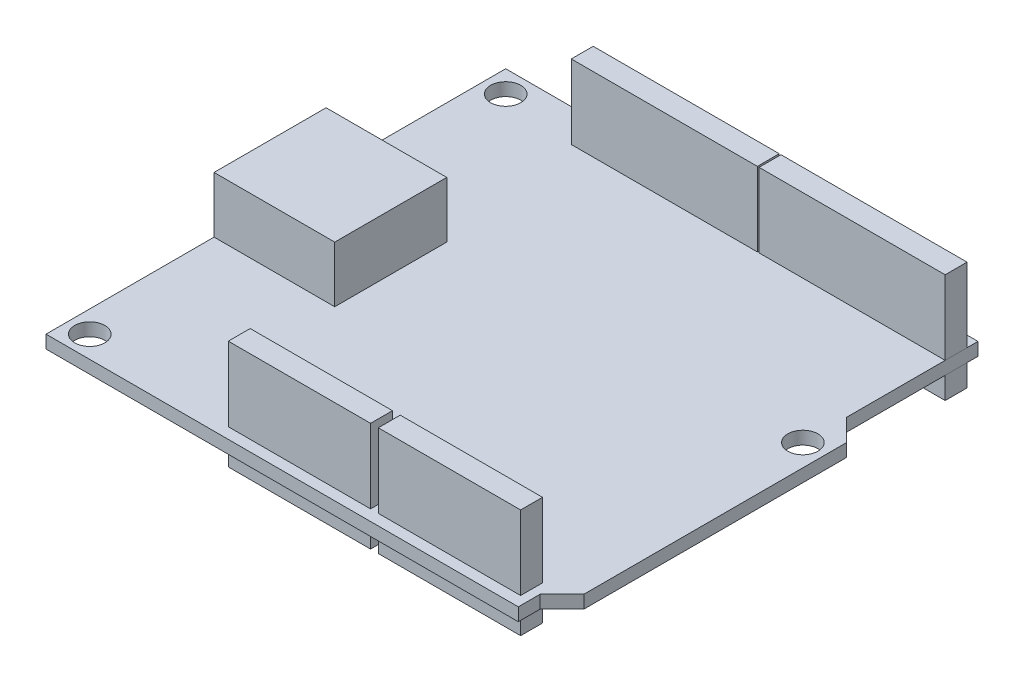
ISO-10303-21;
HEADER;
FILE_DESCRIPTION(('STEP AP214'),'2;1');
FILE_NAME('part.step','',(''),(''),'','','');
FILE_SCHEMA(('AUTOMOTIVE_DESIGN { 1 0 10303 214 1 1 1 1 }'));
ENDSEC;
DATA;
#1=APPLICATION_CONTEXT('core data for automotive mechanical design processes');
#2=APPLICATION_PROTOCOL_DEFINITION('international standard','automotive_design',2000,#1);
#3=PRODUCT_CONTEXT('',#1,'mechanical');
#4=PRODUCT('Part','Part','',(#3));
#5=PRODUCT_RELATED_PRODUCT_CATEGORY('part','',(#4));
#6=PRODUCT_DEFINITION_FORMATION('','',#4);
#7=PRODUCT_DEFINITION_CONTEXT('part definition',#1,'design');
#8=PRODUCT_DEFINITION('design','',#6,#7);
#9=PRODUCT_DEFINITION_SHAPE('','',#8);
#10=(LENGTH_UNIT() NAMED_UNIT(*) SI_UNIT(.MILLI.,.METRE.));
#11=(NAMED_UNIT(*) PLANE_ANGLE_UNIT() SI_UNIT($,.RADIAN.));
#12=(NAMED_UNIT(*) SI_UNIT($,.STERADIAN.) SOLID_ANGLE_UNIT());
#13=UNCERTAINTY_MEASURE_WITH_UNIT(LENGTH_MEASURE(1.E-05),#10,'distance_accuracy_value','');
#14=(GEOMETRIC_REPRESENTATION_CONTEXT(3) GLOBAL_UNCERTAINTY_ASSIGNED_CONTEXT((#13)) GLOBAL_UNIT_ASSIGNED_CONTEXT((#10,
#11,#12)) REPRESENTATION_CONTEXT('',''));
#15=CARTESIAN_POINT('',(0.,0.,0.));
#16=DIRECTION('',(0.,0.,1.));
#17=DIRECTION('',(1.,0.,0.));
#18=AXIS2_PLACEMENT_3D('',#15,#16,#17);
#19=CARTESIAN_POINT('',(5.809,-2.54,-25.4));
#20=DIRECTION('',(-1.,0.,0.));
#21=DIRECTION('',(0.,0.,1.));
#22=AXIS2_PLACEMENT_3D('',#19,#20,#21);
#23=PLANE('',#22);
#24=DIRECTION('',(0.,1.,0.));
#25=VECTOR('',#24,1.);
#26=CARTESIAN_POINT('',(5.809,-2.54,-22.86));
#27=LINE('',#26,#25);
#28=CARTESIAN_POINT('',(5.809,-2.54,-22.86));
#29=VERTEX_POINT('',#28);
#30=CARTESIAN_POINT('',(5.809,10.1,-22.86));
#31=VERTEX_POINT('',#30);
#32=EDGE_CURVE('E50',#29,#31,#27,.T.);
#33=ORIENTED_EDGE('',*,*,#32,.T.);
#34=DIRECTION('',(0.,0.,1.));
#35=VECTOR('',#34,1.);
#36=CARTESIAN_POINT('',(5.809,10.1,-25.4));
#37=LINE('',#36,#35);
#38=CARTESIAN_POINT('',(5.809,10.1,-25.4));
#39=VERTEX_POINT('',#38);
#40=EDGE_CURVE('E87',#39,#31,#37,.T.);
#41=ORIENTED_EDGE('',*,*,#40,.F.);
#42=DIRECTION('',(0.,1.,0.));
#43=VECTOR('',#42,1.);
#44=CARTESIAN_POINT('',(5.809,-2.54,-25.4));
#45=LINE('',#44,#43);
#46=CARTESIAN_POINT('',(5.809,-2.54,-25.4));
#47=VERTEX_POINT('',#46);
#48=EDGE_CURVE('E12',#47,#39,#45,.T.);
#49=ORIENTED_EDGE('',*,*,#48,.F.);
#50=DIRECTION('',(0.,0.,1.));
#51=VECTOR('',#50,1.);
#52=CARTESIAN_POINT('',(5.809,-2.54,-25.4));
#53=LINE('',#52,#51);
#54=EDGE_CURVE('E88',#47,#29,#53,.T.);
#55=ORIENTED_EDGE('',*,*,#54,.T.);
#56=EDGE_LOOP('',(#33,#41,#49,#55));
#57=FACE_BOUND('',#56,.T.);
#58=ADVANCED_FACE('F47',(#57),#23,.T.);
#59=CARTESIAN_POINT('',(5.809,-2.54,-25.4));
#60=DIRECTION('',(0.,0.,-1.));
#61=DIRECTION('',(-1.,0.,0.));
#62=AXIS2_PLACEMENT_3D('',#59,#60,#61);
#63=PLANE('',#62);
#64=ORIENTED_EDGE('',*,*,#48,.T.);
#65=DIRECTION('',(-1.,0.,0.));
#66=VECTOR('',#65,1.);
#67=CARTESIAN_POINT('',(5.809,10.1,-25.4));
#68=LINE('',#67,#66);
#69=CARTESIAN_POINT('',(27.399,10.1,-25.4));
#70=VERTEX_POINT('',#69);
#71=EDGE_CURVE('E104',#70,#39,#68,.T.);
#72=ORIENTED_EDGE('',*,*,#71,.F.);
#73=DIRECTION('',(0.,1.,0.));
#74=VECTOR('',#73,1.);
#75=CARTESIAN_POINT('',(27.399,-2.54,-25.4));
#76=LINE('',#75,#74);
#77=CARTESIAN_POINT('',(27.399,-2.54,-25.4));
#78=VERTEX_POINT('',#77);
#79=EDGE_CURVE('E55',#78,#70,#76,.T.);
#80=ORIENTED_EDGE('',*,*,#79,.F.);
#81=DIRECTION('',(-1.,0.,0.));
#82=VECTOR('',#81,1.);
#83=CARTESIAN_POINT('',(5.809,-2.54,-25.4));
#84=LINE('',#83,#82);
#85=EDGE_CURVE('E93',#78,#47,#84,.T.);
#86=ORIENTED_EDGE('',*,*,#85,.T.);
#87=EDGE_LOOP('',(#64,#72,#80,#86));
#88=FACE_BOUND('',#87,.T.);
#89=ADVANCED_FACE('F119',(#88),#63,.T.);
#90=CARTESIAN_POINT('',(27.399,-2.54,-25.4));
#91=DIRECTION('',(1.,0.,0.));
#92=DIRECTION('',(0.,0.,-1.));
#93=AXIS2_PLACEMENT_3D('',#90,#91,#92);
#94=PLANE('',#93);
#95=ORIENTED_EDGE('',*,*,#79,.T.);
#96=DIRECTION('',(0.,0.,-1.));
#97=VECTOR('',#96,1.);
#98=CARTESIAN_POINT('',(27.399,10.1,-25.4));
#99=LINE('',#98,#97);
#100=CARTESIAN_POINT('',(27.399,10.1,-22.86));
#101=VERTEX_POINT('',#100);
#102=EDGE_CURVE('E100',#101,#70,#99,.T.);
#103=ORIENTED_EDGE('',*,*,#102,.F.);
#104=DIRECTION('',(0.,1.,0.));
#105=VECTOR('',#104,1.);
#106=CARTESIAN_POINT('',(27.399,-2.54,-22.86));
#107=LINE('',#106,#105);
#108=CARTESIAN_POINT('',(27.399,-2.54,-22.86));
#109=VERTEX_POINT('',#108);
#110=EDGE_CURVE('E92',#109,#101,#107,.T.);
#111=ORIENTED_EDGE('',*,*,#110,.F.);
#112=DIRECTION('',(0.,0.,-1.));
#113=VECTOR('',#112,1.);
#114=CARTESIAN_POINT('',(27.399,-2.54,-25.4));
#115=LINE('',#114,#113);
#116=EDGE_CURVE('E112',#109,#78,#115,.T.);
#117=ORIENTED_EDGE('',*,*,#116,.T.);
#118=EDGE_LOOP('',(#95,#103,#111,#117));
#119=FACE_BOUND('',#118,.T.);
#120=ADVANCED_FACE('F116',(#119),#94,.T.);
#121=CARTESIAN_POINT('',(5.809,-2.54,-22.86));
#122=DIRECTION('',(0.,0.,1.));
#123=DIRECTION('',(1.,0.,0.));
#124=AXIS2_PLACEMENT_3D('',#121,#122,#123);
#125=PLANE('',#124);
#126=ORIENTED_EDGE('',*,*,#110,.T.);
#127=DIRECTION('',(1.,0.,0.));
#128=VECTOR('',#127,1.);
#129=CARTESIAN_POINT('',(5.809,10.1,-22.86));
#130=LINE('',#129,#128);
#131=EDGE_CURVE('E95',#31,#101,#130,.T.);
#132=ORIENTED_EDGE('',*,*,#131,.F.);
#133=ORIENTED_EDGE('',*,*,#32,.F.);
#134=DIRECTION('',(1.,0.,0.));
#135=VECTOR('',#134,1.);
#136=CARTESIAN_POINT('',(5.809,-2.54,-22.86));
#137=LINE('',#136,#135);
#138=EDGE_CURVE('E110',#29,#109,#137,.T.);
#139=ORIENTED_EDGE('',*,*,#138,.T.);
#140=EDGE_LOOP('',(#126,#132,#133,#139));
#141=FACE_BOUND('',#140,.T.);
#142=ADVANCED_FACE('F96',(#141),#125,.T.);
#143=CARTESIAN_POINT('',(0.,-2.54,0.));
#144=DIRECTION('',(0.,1.,0.));
#145=DIRECTION('',(0.,0.,1.));
#146=AXIS2_PLACEMENT_3D('',#143,#144,#145);
#147=PLANE('',#146);
#148=ORIENTED_EDGE('',*,*,#54,.F.);
#149=ORIENTED_EDGE('',*,*,#85,.F.);
#150=ORIENTED_EDGE('',*,*,#116,.F.);
#151=ORIENTED_EDGE('',*,*,#138,.F.);
#152=EDGE_LOOP('',(#148,#149,#150,#151));
#153=FACE_BOUND('',#152,.T.);
#154=ADVANCED_FACE('F121',(#153),#147,.F.);
#155=CARTESIAN_POINT('',(0.,10.1,0.));
#156=DIRECTION('',(0.,1.,0.));
#157=DIRECTION('',(0.,0.,1.));
#158=AXIS2_PLACEMENT_3D('',#155,#156,#157);
#159=PLANE('',#158);
#160=ORIENTED_EDGE('',*,*,#40,.T.);
#161=ORIENTED_EDGE('',*,*,#131,.T.);
#162=ORIENTED_EDGE('',*,*,#102,.T.);
#163=ORIENTED_EDGE('',*,*,#71,.T.);
#164=EDGE_LOOP('',(#160,#161,#162,#163));
#165=FACE_BOUND('',#164,.T.);
#166=ADVANCED_FACE('F103',(#165),#159,.T.);
#167=CLOSED_SHELL('',(#58,#89,#120,#142,#154,#166));
#168=MANIFOLD_SOLID_BREP('B2',#167);
#169=CARTESIAN_POINT('',(-15.981,-2.54,-25.4));
#170=DIRECTION('',(-1.,0.,0.));
#171=DIRECTION('',(0.,0.,1.));
#172=AXIS2_PLACEMENT_3D('',#169,#170,#171);
#173=PLANE('',#172);
#174=DIRECTION('',(0.,1.,0.));
#175=VECTOR('',#174,1.);
#176=CARTESIAN_POINT('',(-15.981,-2.54,-22.86));
#177=LINE('',#176,#175);
#178=CARTESIAN_POINT('',(-15.981,-2.54,-22.86));
#179=VERTEX_POINT('',#178);
#180=CARTESIAN_POINT('',(-15.981,10.1,-22.86));
#181=VERTEX_POINT('',#180);
#182=EDGE_CURVE('E183',#179,#181,#177,.T.);
#183=ORIENTED_EDGE('',*,*,#182,.T.);
#184=DIRECTION('',(0.,0.,1.));
#185=VECTOR('',#184,1.);
#186=CARTESIAN_POINT('',(-15.981,10.1,-25.4));
#187=LINE('',#186,#185);
#188=CARTESIAN_POINT('',(-15.981,10.1,-25.4));
#189=VERTEX_POINT('',#188);
#190=EDGE_CURVE('E220',#189,#181,#187,.T.);
#191=ORIENTED_EDGE('',*,*,#190,.F.);
#192=DIRECTION('',(0.,1.,0.));
#193=VECTOR('',#192,1.);
#194=CARTESIAN_POINT('',(-15.981,-2.54,-25.4));
#195=LINE('',#194,#193);
#196=CARTESIAN_POINT('',(-15.981,-2.54,-25.4));
#197=VERTEX_POINT('',#196);
#198=EDGE_CURVE('E45',#197,#189,#195,.T.);
#199=ORIENTED_EDGE('',*,*,#198,.F.);
#200=DIRECTION('',(0.,0.,1.));
#201=VECTOR('',#200,1.);
#202=CARTESIAN_POINT('',(-15.981,-2.54,-25.4));
#203=LINE('',#202,#201);
#204=EDGE_CURVE('E221',#197,#179,#203,.T.);
#205=ORIENTED_EDGE('',*,*,#204,.T.);
#206=EDGE_LOOP('',(#183,#191,#199,#205));
#207=FACE_BOUND('',#206,.T.);
#208=ADVANCED_FACE('F180',(#207),#173,.T.);
#209=CARTESIAN_POINT('',(-15.981,-2.54,-25.4));
#210=DIRECTION('',(0.,0.,-1.));
#211=DIRECTION('',(-1.,0.,0.));
#212=AXIS2_PLACEMENT_3D('',#209,#210,#211);
#213=PLANE('',#212);
#214=ORIENTED_EDGE('',*,*,#198,.T.);
#215=DIRECTION('',(-1.,0.,0.));
#216=VECTOR('',#215,1.);
#217=CARTESIAN_POINT('',(-15.981,10.1,-25.4));
#218=LINE('',#217,#216);
#219=CARTESIAN_POINT('',(5.609,10.1,-25.4));
#220=VERTEX_POINT('',#219);
#221=EDGE_CURVE('E237',#220,#189,#218,.T.);
#222=ORIENTED_EDGE('',*,*,#221,.F.);
#223=DIRECTION('',(0.,1.,0.));
#224=VECTOR('',#223,1.);
#225=CARTESIAN_POINT('',(5.609,-2.54,-25.4));
#226=LINE('',#225,#224);
#227=CARTESIAN_POINT('',(5.609,-2.54,-25.4));
#228=VERTEX_POINT('',#227);
#229=EDGE_CURVE('E188',#228,#220,#226,.T.);
#230=ORIENTED_EDGE('',*,*,#229,.F.);
#231=DIRECTION('',(-1.,0.,0.));
#232=VECTOR('',#231,1.);
#233=CARTESIAN_POINT('',(-15.981,-2.54,-25.4));
#234=LINE('',#233,#232);
#235=EDGE_CURVE('E226',#228,#197,#234,.T.);
#236=ORIENTED_EDGE('',*,*,#235,.T.);
#237=EDGE_LOOP('',(#214,#222,#230,#236));
#238=FACE_BOUND('',#237,.T.);
#239=ADVANCED_FACE('F252',(#238),#213,.T.);
#240=CARTESIAN_POINT('',(5.609,-2.54,-25.4));
#241=DIRECTION('',(1.,0.,0.));
#242=DIRECTION('',(0.,0.,-1.));
#243=AXIS2_PLACEMENT_3D('',#240,#241,#242);
#244=PLANE('',#243);
#245=ORIENTED_EDGE('',*,*,#229,.T.);
#246=DIRECTION('',(0.,0.,-1.));
#247=VECTOR('',#246,1.);
#248=CARTESIAN_POINT('',(5.609,10.1,-25.4));
#249=LINE('',#248,#247);
#250=CARTESIAN_POINT('',(5.609,10.1,-22.86));
#251=VERTEX_POINT('',#250);
#252=EDGE_CURVE('E233',#251,#220,#249,.T.);
#253=ORIENTED_EDGE('',*,*,#252,.F.);
#254=DIRECTION('',(0.,1.,0.));
#255=VECTOR('',#254,1.);
#256=CARTESIAN_POINT('',(5.609,-2.54,-22.86));
#257=LINE('',#256,#255);
#258=CARTESIAN_POINT('',(5.609,-2.54,-22.86));
#259=VERTEX_POINT('',#258);
#260=EDGE_CURVE('E225',#259,#251,#257,.T.);
#261=ORIENTED_EDGE('',*,*,#260,.F.);
#262=DIRECTION('',(0.,0.,-1.));
#263=VECTOR('',#262,1.);
#264=CARTESIAN_POINT('',(5.609,-2.54,-25.4));
#265=LINE('',#264,#263);
#266=EDGE_CURVE('E245',#259,#228,#265,.T.);
#267=ORIENTED_EDGE('',*,*,#266,.T.);
#268=EDGE_LOOP('',(#245,#253,#261,#267));
#269=FACE_BOUND('',#268,.T.);
#270=ADVANCED_FACE('F249',(#269),#244,.T.);
#271=CARTESIAN_POINT('',(-15.981,-2.54,-22.86));
#272=DIRECTION('',(0.,0.,1.));
#273=DIRECTION('',(1.,0.,0.));
#274=AXIS2_PLACEMENT_3D('',#271,#272,#273);
#275=PLANE('',#274);
#276=ORIENTED_EDGE('',*,*,#260,.T.);
#277=DIRECTION('',(1.,0.,0.));
#278=VECTOR('',#277,1.);
#279=CARTESIAN_POINT('',(-15.981,10.1,-22.86));
#280=LINE('',#279,#278);
#281=EDGE_CURVE('E228',#181,#251,#280,.T.);
#282=ORIENTED_EDGE('',*,*,#281,.F.);
#283=ORIENTED_EDGE('',*,*,#182,.F.);
#284=DIRECTION('',(1.,0.,0.));
#285=VECTOR('',#284,1.);
#286=CARTESIAN_POINT('',(-15.981,-2.54,-22.86));
#287=LINE('',#286,#285);
#288=EDGE_CURVE('E243',#179,#259,#287,.T.);
#289=ORIENTED_EDGE('',*,*,#288,.T.);
#290=EDGE_LOOP('',(#276,#282,#283,#289));
#291=FACE_BOUND('',#290,.T.);
#292=ADVANCED_FACE('F229',(#291),#275,.T.);
#293=CARTESIAN_POINT('',(0.,-2.54,0.));
#294=DIRECTION('',(0.,1.,0.));
#295=DIRECTION('',(0.,0.,1.));
#296=AXIS2_PLACEMENT_3D('',#293,#294,#295);
#297=PLANE('',#296);
#298=ORIENTED_EDGE('',*,*,#204,.F.);
#299=ORIENTED_EDGE('',*,*,#235,.F.);
#300=ORIENTED_EDGE('',*,*,#266,.F.);
#301=ORIENTED_EDGE('',*,*,#288,.F.);
#302=EDGE_LOOP('',(#298,#299,#300,#301));
#303=FACE_BOUND('',#302,.T.);
#304=ADVANCED_FACE('F254',(#303),#297,.F.);
#305=CARTESIAN_POINT('',(0.,10.1,0.));
#306=DIRECTION('',(0.,1.,0.));
#307=DIRECTION('',(0.,0.,1.));
#308=AXIS2_PLACEMENT_3D('',#305,#306,#307);
#309=PLANE('',#308);
#310=ORIENTED_EDGE('',*,*,#190,.T.);
#311=ORIENTED_EDGE('',*,*,#281,.T.);
#312=ORIENTED_EDGE('',*,*,#252,.T.);
#313=ORIENTED_EDGE('',*,*,#221,.T.);
#314=EDGE_LOOP('',(#310,#311,#312,#313));
#315=FACE_BOUND('',#314,.T.);
#316=ADVANCED_FACE('F236',(#315),#309,.T.);
#317=CLOSED_SHELL('',(#208,#239,#270,#292,#304,#316));
#318=MANIFOLD_SOLID_BREP('B6',#317);
#319=CARTESIAN_POINT('',(9.88999999999999,-2.54,22.86));
#320=DIRECTION('',(-1.,0.,0.));
#321=DIRECTION('',(0.,0.,1.));
#322=AXIS2_PLACEMENT_3D('',#319,#320,#321);
#323=PLANE('',#322);
#324=DIRECTION('',(0.,1.,0.));
#325=VECTOR('',#324,1.);
#326=CARTESIAN_POINT('',(9.88999999999999,-2.54,25.4));
#327=LINE('',#326,#325);
#328=CARTESIAN_POINT('',(9.88999999999999,-2.54,25.4));
#329=VERTEX_POINT('',#328);
#330=CARTESIAN_POINT('',(9.88999999999999,10.1,25.4));
#331=VERTEX_POINT('',#330);
#332=EDGE_CURVE('E316',#329,#331,#327,.T.);
#333=ORIENTED_EDGE('',*,*,#332,.T.);
#334=DIRECTION('',(0.,0.,1.));
#335=VECTOR('',#334,1.);
#336=CARTESIAN_POINT('',(9.88999999999999,10.1,22.86));
#337=LINE('',#336,#335);
#338=CARTESIAN_POINT('',(9.88999999999999,10.1,22.86));
#339=VERTEX_POINT('',#338);
#340=EDGE_CURVE('E353',#339,#331,#337,.T.);
#341=ORIENTED_EDGE('',*,*,#340,.F.);
#342=DIRECTION('',(0.,1.,0.));
#343=VECTOR('',#342,1.);
#344=CARTESIAN_POINT('',(9.88999999999999,-2.54,22.86));
#345=LINE('',#344,#343);
#346=CARTESIAN_POINT('',(9.88999999999999,-2.54,22.86));
#347=VERTEX_POINT('',#346);
#348=EDGE_CURVE('E178',#347,#339,#345,.T.);
#349=ORIENTED_EDGE('',*,*,#348,.F.);
#350=DIRECTION('',(0.,0.,1.));
#351=VECTOR('',#350,1.);
#352=CARTESIAN_POINT('',(9.88999999999999,-2.54,22.86));
#353=LINE('',#352,#351);
#354=EDGE_CURVE('E354',#347,#329,#353,.T.);
#355=ORIENTED_EDGE('',*,*,#354,.T.);
#356=EDGE_LOOP('',(#333,#341,#349,#355));
#357=FACE_BOUND('',#356,.T.);
#358=ADVANCED_FACE('F313',(#357),#323,.T.);
#359=CARTESIAN_POINT('',(9.88999999999999,-2.54,22.86));
#360=DIRECTION('',(0.,0.,-1.));
#361=DIRECTION('',(-1.,0.,0.));
#362=AXIS2_PLACEMENT_3D('',#359,#360,#361);
#363=PLANE('',#362);
#364=ORIENTED_EDGE('',*,*,#348,.T.);
#365=DIRECTION('',(-1.,0.,0.));
#366=VECTOR('',#365,1.);
#367=CARTESIAN_POINT('',(9.88999999999999,10.1,22.86));
#368=LINE('',#367,#366);
#369=CARTESIAN_POINT('',(26.4,10.1,22.86));
#370=VERTEX_POINT('',#369);
#371=EDGE_CURVE('E370',#370,#339,#368,.T.);
#372=ORIENTED_EDGE('',*,*,#371,.F.);
#373=DIRECTION('',(0.,1.,0.));
#374=VECTOR('',#373,1.);
#375=CARTESIAN_POINT('',(26.4,-2.54,22.86));
#376=LINE('',#375,#374);
#377=CARTESIAN_POINT('',(26.4,-2.54,22.86));
#378=VERTEX_POINT('',#377);
#379=EDGE_CURVE('E321',#378,#370,#376,.T.);
#380=ORIENTED_EDGE('',*,*,#379,.F.);
#381=DIRECTION('',(-1.,0.,0.));
#382=VECTOR('',#381,1.);
#383=CARTESIAN_POINT('',(9.88999999999999,-2.54,22.86));
#384=LINE('',#383,#382);
#385=EDGE_CURVE('E359',#378,#347,#384,.T.);
#386=ORIENTED_EDGE('',*,*,#385,.T.);
#387=EDGE_LOOP('',(#364,#372,#380,#386));
#388=FACE_BOUND('',#387,.T.);
#389=ADVANCED_FACE('F385',(#388),#363,.T.);
#390=CARTESIAN_POINT('',(26.4,-2.54,22.86));
#391=DIRECTION('',(1.,0.,0.));
#392=DIRECTION('',(0.,0.,-1.));
#393=AXIS2_PLACEMENT_3D('',#390,#391,#392);
#394=PLANE('',#393);
#395=ORIENTED_EDGE('',*,*,#379,.T.);
#396=DIRECTION('',(0.,0.,-1.));
#397=VECTOR('',#396,1.);
#398=CARTESIAN_POINT('',(26.4,10.1,22.86));
#399=LINE('',#398,#397);
#400=CARTESIAN_POINT('',(26.4,10.1,25.4));
#401=VERTEX_POINT('',#400);
#402=EDGE_CURVE('E366',#401,#370,#399,.T.);
#403=ORIENTED_EDGE('',*,*,#402,.F.);
#404=DIRECTION('',(0.,1.,0.));
#405=VECTOR('',#404,1.);
#406=CARTESIAN_POINT('',(26.4,-2.54,25.4));
#407=LINE('',#406,#405);
#408=CARTESIAN_POINT('',(26.4,-2.54,25.4));
#409=VERTEX_POINT('',#408);
#410=EDGE_CURVE('E358',#409,#401,#407,.T.);
#411=ORIENTED_EDGE('',*,*,#410,.F.);
#412=DIRECTION('',(0.,0.,-1.));
#413=VECTOR('',#412,1.);
#414=CARTESIAN_POINT('',(26.4,-2.54,22.86));
#415=LINE('',#414,#413);
#416=EDGE_CURVE('E378',#409,#378,#415,.T.);
#417=ORIENTED_EDGE('',*,*,#416,.T.);
#418=EDGE_LOOP('',(#395,#403,#411,#417));
#419=FACE_BOUND('',#418,.T.);
#420=ADVANCED_FACE('F382',(#419),#394,.T.);
#421=CARTESIAN_POINT('',(9.88999999999999,-2.54,25.4));
#422=DIRECTION('',(0.,0.,1.));
#423=DIRECTION('',(1.,0.,0.));
#424=AXIS2_PLACEMENT_3D('',#421,#422,#423);
#425=PLANE('',#424);
#426=ORIENTED_EDGE('',*,*,#410,.T.);
#427=DIRECTION('',(1.,0.,0.));
#428=VECTOR('',#427,1.);
#429=CARTESIAN_POINT('',(9.88999999999999,10.1,25.4));
#430=LINE('',#429,#428);
#431=EDGE_CURVE('E361',#331,#401,#430,.T.);
#432=ORIENTED_EDGE('',*,*,#431,.F.);
#433=ORIENTED_EDGE('',*,*,#332,.F.);
#434=DIRECTION('',(1.,0.,0.));
#435=VECTOR('',#434,1.);
#436=CARTESIAN_POINT('',(9.88999999999999,-2.54,25.4));
#437=LINE('',#436,#435);
#438=EDGE_CURVE('E376',#329,#409,#437,.T.);
#439=ORIENTED_EDGE('',*,*,#438,.T.);
#440=EDGE_LOOP('',(#426,#432,#433,#439));
#441=FACE_BOUND('',#440,.T.);
#442=ADVANCED_FACE('F362',(#441),#425,.T.);
#443=CARTESIAN_POINT('',(0.,-2.54,0.));
#444=DIRECTION('',(0.,1.,0.));
#445=DIRECTION('',(0.,0.,1.));
#446=AXIS2_PLACEMENT_3D('',#443,#444,#445);
#447=PLANE('',#446);
#448=ORIENTED_EDGE('',*,*,#354,.F.);
#449=ORIENTED_EDGE('',*,*,#385,.F.);
#450=ORIENTED_EDGE('',*,*,#416,.F.);
#451=ORIENTED_EDGE('',*,*,#438,.F.);
#452=EDGE_LOOP('',(#448,#449,#450,#451));
#453=FACE_BOUND('',#452,.T.);
#454=ADVANCED_FACE('F387',(#453),#447,.F.);
#455=CARTESIAN_POINT('',(0.,10.1,0.));
#456=DIRECTION('',(0.,1.,0.));
#457=DIRECTION('',(0.,0.,1.));
#458=AXIS2_PLACEMENT_3D('',#455,#456,#457);
#459=PLANE('',#458);
#460=ORIENTED_EDGE('',*,*,#340,.T.);
#461=ORIENTED_EDGE('',*,*,#431,.T.);
#462=ORIENTED_EDGE('',*,*,#402,.T.);
#463=ORIENTED_EDGE('',*,*,#371,.T.);
#464=EDGE_LOOP('',(#460,#461,#462,#463));
#465=FACE_BOUND('',#464,.T.);
#466=ADVANCED_FACE('F369',(#465),#459,.T.);
#467=CLOSED_SHELL('',(#358,#389,#420,#442,#454,#466));
#468=MANIFOLD_SOLID_BREP('B39',#467);
#469=CARTESIAN_POINT('',(-7.52000000000002,-2.54,22.86));
#470=DIRECTION('',(-1.,0.,0.));
#471=DIRECTION('',(0.,0.,1.));
#472=AXIS2_PLACEMENT_3D('',#469,#470,#471);
#473=PLANE('',#472);
#474=DIRECTION('',(0.,1.,0.));
#475=VECTOR('',#474,1.);
#476=CARTESIAN_POINT('',(-7.52000000000001,-2.54,25.4));
#477=LINE('',#476,#475);
#478=CARTESIAN_POINT('',(-7.52000000000001,-2.54,25.4));
#479=VERTEX_POINT('',#478);
#480=CARTESIAN_POINT('',(-7.52000000000001,10.1,25.4));
#481=VERTEX_POINT('',#480);
#482=EDGE_CURVE('E449',#479,#481,#477,.T.);
#483=ORIENTED_EDGE('',*,*,#482,.T.);
#484=DIRECTION('',(0.,0.,1.));
#485=VECTOR('',#484,1.);
#486=CARTESIAN_POINT('',(-7.52000000000002,10.1,22.86));
#487=LINE('',#486,#485);
#488=CARTESIAN_POINT('',(-7.52000000000002,10.1,22.86));
#489=VERTEX_POINT('',#488);
#490=EDGE_CURVE('E486',#489,#481,#487,.T.);
#491=ORIENTED_EDGE('',*,*,#490,.F.);
#492=DIRECTION('',(0.,1.,0.));
#493=VECTOR('',#492,1.);
#494=CARTESIAN_POINT('',(-7.52000000000002,-2.54,22.86));
#495=LINE('',#494,#493);
#496=CARTESIAN_POINT('',(-7.52000000000002,-2.54,22.86));
#497=VERTEX_POINT('',#496);
#498=EDGE_CURVE('E311',#497,#489,#495,.T.);
#499=ORIENTED_EDGE('',*,*,#498,.F.);
#500=DIRECTION('',(0.,0.,1.));
#501=VECTOR('',#500,1.);
#502=CARTESIAN_POINT('',(-7.52000000000002,-2.54,22.86));
#503=LINE('',#502,#501);
#504=EDGE_CURVE('E487',#497,#479,#503,.T.);
#505=ORIENTED_EDGE('',*,*,#504,.T.);
#506=EDGE_LOOP('',(#483,#491,#499,#505));
#507=FACE_BOUND('',#506,.T.);
#508=ADVANCED_FACE('F446',(#507),#473,.T.);
#509=CARTESIAN_POINT('',(-7.52000000000002,-2.54,22.86));
#510=DIRECTION('',(0.,0.,-1.));
#511=DIRECTION('',(-1.,0.,0.));
#512=AXIS2_PLACEMENT_3D('',#509,#510,#511);
#513=PLANE('',#512);
#514=ORIENTED_EDGE('',*,*,#498,.T.);
#515=DIRECTION('',(-1.,0.,0.));
#516=VECTOR('',#515,1.);
#517=CARTESIAN_POINT('',(-7.52000000000002,10.1,22.86));
#518=LINE('',#517,#516);
#519=CARTESIAN_POINT('',(8.98999999999999,10.1,22.86));
#520=VERTEX_POINT('',#519);
#521=EDGE_CURVE('E503',#520,#489,#518,.T.);
#522=ORIENTED_EDGE('',*,*,#521,.F.);
#523=DIRECTION('',(0.,1.,0.));
#524=VECTOR('',#523,1.);
#525=CARTESIAN_POINT('',(8.98999999999999,-2.54,22.86));
#526=LINE('',#525,#524);
#527=CARTESIAN_POINT('',(8.98999999999999,-2.54,22.86));
#528=VERTEX_POINT('',#527);
#529=EDGE_CURVE('E454',#528,#520,#526,.T.);
#530=ORIENTED_EDGE('',*,*,#529,.F.);
#531=DIRECTION('',(-1.,0.,0.));
#532=VECTOR('',#531,1.);
#533=CARTESIAN_POINT('',(-7.52000000000002,-2.54,22.86));
#534=LINE('',#533,#532);
#535=EDGE_CURVE('E492',#528,#497,#534,.T.);
#536=ORIENTED_EDGE('',*,*,#535,.T.);
#537=EDGE_LOOP('',(#514,#522,#530,#536));
#538=FACE_BOUND('',#537,.T.);
#539=ADVANCED_FACE('F518',(#538),#513,.T.);
#540=CARTESIAN_POINT('',(8.98999999999999,-2.54,22.86));
#541=DIRECTION('',(1.,0.,0.));
#542=DIRECTION('',(0.,0.,-1.));
#543=AXIS2_PLACEMENT_3D('',#540,#541,#542);
#544=PLANE('',#543);
#545=ORIENTED_EDGE('',*,*,#529,.T.);
#546=DIRECTION('',(0.,0.,-1.));
#547=VECTOR('',#546,1.);
#548=CARTESIAN_POINT('',(8.98999999999999,10.1,22.86));
#549=LINE('',#548,#547);
#550=CARTESIAN_POINT('',(8.98999999999999,10.1,25.4));
#551=VERTEX_POINT('',#550);
#552=EDGE_CURVE('E499',#551,#520,#549,.T.);
#553=ORIENTED_EDGE('',*,*,#552,.F.);
#554=DIRECTION('',(0.,1.,0.));
#555=VECTOR('',#554,1.);
#556=CARTESIAN_POINT('',(8.98999999999999,-2.54,25.4));
#557=LINE('',#556,#555);
#558=CARTESIAN_POINT('',(8.98999999999999,-2.54,25.4));
#559=VERTEX_POINT('',#558);
#560=EDGE_CURVE('E491',#559,#551,#557,.T.);
#561=ORIENTED_EDGE('',*,*,#560,.F.);
#562=DIRECTION('',(0.,0.,-1.));
#563=VECTOR('',#562,1.);
#564=CARTESIAN_POINT('',(8.98999999999999,-2.54,22.86));
#565=LINE('',#564,#563);
#566=EDGE_CURVE('E511',#559,#528,#565,.T.);
#567=ORIENTED_EDGE('',*,*,#566,.T.);
#568=EDGE_LOOP('',(#545,#553,#561,#567));
#569=FACE_BOUND('',#568,.T.);
#570=ADVANCED_FACE('F515',(#569),#544,.T.);
#571=CARTESIAN_POINT('',(-7.52000000000001,-2.54,25.4));
#572=DIRECTION('',(0.,0.,1.));
#573=DIRECTION('',(1.,0.,0.));
#574=AXIS2_PLACEMENT_3D('',#571,#572,#573);
#575=PLANE('',#574);
#576=ORIENTED_EDGE('',*,*,#560,.T.);
#577=DIRECTION('',(1.,0.,0.));
#578=VECTOR('',#577,1.);
#579=CARTESIAN_POINT('',(-7.52000000000001,10.1,25.4));
#580=LINE('',#579,#578);
#581=EDGE_CURVE('E494',#481,#551,#580,.T.);
#582=ORIENTED_EDGE('',*,*,#581,.F.);
#583=ORIENTED_EDGE('',*,*,#482,.F.);
#584=DIRECTION('',(1.,0.,0.));
#585=VECTOR('',#584,1.);
#586=CARTESIAN_POINT('',(-7.52000000000001,-2.54,25.4));
#587=LINE('',#586,#585);
#588=EDGE_CURVE('E509',#479,#559,#587,.T.);
#589=ORIENTED_EDGE('',*,*,#588,.T.);
#590=EDGE_LOOP('',(#576,#582,#583,#589));
#591=FACE_BOUND('',#590,.T.);
#592=ADVANCED_FACE('F495',(#591),#575,.T.);
#593=CARTESIAN_POINT('',(0.,-2.54,0.));
#594=DIRECTION('',(0.,1.,0.));
#595=DIRECTION('',(0.,0.,1.));
#596=AXIS2_PLACEMENT_3D('',#593,#594,#595);
#597=PLANE('',#596);
#598=ORIENTED_EDGE('',*,*,#504,.F.);
#599=ORIENTED_EDGE('',*,*,#535,.F.);
#600=ORIENTED_EDGE('',*,*,#566,.F.);
#601=ORIENTED_EDGE('',*,*,#588,.F.);
#602=EDGE_LOOP('',(#598,#599,#600,#601));
#603=FACE_BOUND('',#602,.T.);
#604=ADVANCED_FACE('F520',(#603),#597,.F.);
#605=CARTESIAN_POINT('',(0.,10.1,0.));
#606=DIRECTION('',(0.,1.,0.));
#607=DIRECTION('',(0.,0.,1.));
#608=AXIS2_PLACEMENT_3D('',#605,#606,#607);
#609=PLANE('',#608);
#610=ORIENTED_EDGE('',*,*,#490,.T.);
#611=ORIENTED_EDGE('',*,*,#581,.T.);
#612=ORIENTED_EDGE('',*,*,#552,.T.);
#613=ORIENTED_EDGE('',*,*,#521,.T.);
#614=EDGE_LOOP('',(#610,#611,#612,#613));
#615=FACE_BOUND('',#614,.T.);
#616=ADVANCED_FACE('F502',(#615),#609,.T.);
#617=CLOSED_SHELL('',(#508,#539,#570,#592,#604,#616));
#618=MANIFOLD_SOLID_BREP('B172',#617);
#619=CARTESIAN_POINT('',(-27.4,8.,-5.82999999999999));
#620=DIRECTION('',(1.,0.,0.));
#621=DIRECTION('',(0.,0.,-1.));
#622=AXIS2_PLACEMENT_3D('',#619,#620,#621);
#623=PLANE('',#622);
#624=DIRECTION('',(0.,0.,1.));
#625=VECTOR('',#624,1.);
#626=CARTESIAN_POINT('',(-27.4,1.5,-5.82999999999999));
#627=LINE('',#626,#625);
#628=CARTESIAN_POINT('',(-27.4,1.5,-5.82999999999999));
#629=VERTEX_POINT('',#628);
#630=CARTESIAN_POINT('',(-27.4,1.5,7.17000000000001));
#631=VERTEX_POINT('',#630);
#632=EDGE_CURVE('E641',#629,#631,#627,.T.);
#633=ORIENTED_EDGE('',*,*,#632,.T.);
#634=DIRECTION('',(0.,-1.,0.));
#635=VECTOR('',#634,1.);
#636=CARTESIAN_POINT('',(-27.4,8.,7.17000000000001));
#637=LINE('',#636,#635);
#638=CARTESIAN_POINT('',(-27.4,8.,7.17000000000001));
#639=VERTEX_POINT('',#638);
#640=EDGE_CURVE('E444',#639,#631,#637,.T.);
#641=ORIENTED_EDGE('',*,*,#640,.F.);
#642=DIRECTION('',(0.,0.,1.));
#643=VECTOR('',#642,1.);
#644=CARTESIAN_POINT('',(-27.4,8.,-5.82999999999999));
#645=LINE('',#644,#643);
#646=CARTESIAN_POINT('',(-27.4,8.,-5.82999999999999));
#647=VERTEX_POINT('',#646);
#648=EDGE_CURVE('E629',#647,#639,#645,.T.);
#649=ORIENTED_EDGE('',*,*,#648,.F.);
#650=DIRECTION('',(0.,-1.,0.));
#651=VECTOR('',#650,1.);
#652=CARTESIAN_POINT('',(-27.4,8.,-5.82999999999999));
#653=LINE('',#652,#651);
#654=EDGE_CURVE('E637',#647,#629,#653,.T.);
#655=ORIENTED_EDGE('',*,*,#654,.T.);
#656=EDGE_LOOP('',(#633,#641,#649,#655));
#657=FACE_BOUND('',#656,.T.);
#658=ADVANCED_FACE('F578',(#657),#623,.F.);
#659=CARTESIAN_POINT('',(-27.4,8.,7.17000000000001));
#660=DIRECTION('',(0.,0.,-1.));
#661=DIRECTION('',(-1.,0.,0.));
#662=AXIS2_PLACEMENT_3D('',#659,#660,#661);
#663=PLANE('',#662);
#664=DIRECTION('',(1.,0.,0.));
#665=VECTOR('',#664,1.);
#666=CARTESIAN_POINT('',(-27.4,1.5,7.17000000000001));
#667=LINE('',#666,#665);
#668=CARTESIAN_POINT('',(-13.4,1.5,7.17000000000001));
#669=VERTEX_POINT('',#668);
#670=EDGE_CURVE('E633',#631,#669,#667,.T.);
#671=ORIENTED_EDGE('',*,*,#670,.T.);
#672=DIRECTION('',(0.,-1.,0.));
#673=VECTOR('',#672,1.);
#674=CARTESIAN_POINT('',(-13.4,8.,7.17000000000001));
#675=LINE('',#674,#673);
#676=CARTESIAN_POINT('',(-13.4,8.,7.17000000000001));
#677=VERTEX_POINT('',#676);
#678=EDGE_CURVE('E586',#677,#669,#675,.T.);
#679=ORIENTED_EDGE('',*,*,#678,.F.);
#680=DIRECTION('',(1.,0.,0.));
#681=VECTOR('',#680,1.);
#682=CARTESIAN_POINT('',(-27.4,8.,7.17000000000001));
#683=LINE('',#682,#681);
#684=EDGE_CURVE('E624',#639,#677,#683,.T.);
#685=ORIENTED_EDGE('',*,*,#684,.F.);
#686=ORIENTED_EDGE('',*,*,#640,.T.);
#687=EDGE_LOOP('',(#671,#679,#685,#686));
#688=FACE_BOUND('',#687,.T.);
#689=ADVANCED_FACE('F632',(#688),#663,.F.);
#690=CARTESIAN_POINT('',(-13.4,8.,-5.82999999999999));
#691=DIRECTION('',(-1.,0.,0.));
#692=DIRECTION('',(0.,0.,1.));
#693=AXIS2_PLACEMENT_3D('',#690,#691,#692);
#694=PLANE('',#693);
#695=DIRECTION('',(0.,0.,-1.));
#696=VECTOR('',#695,1.);
#697=CARTESIAN_POINT('',(-13.4,1.5,-5.82999999999999));
#698=LINE('',#697,#696);
#699=CARTESIAN_POINT('',(-13.4,1.5,-5.82999999999999));
#700=VERTEX_POINT('',#699);
#701=EDGE_CURVE('E611',#669,#700,#698,.T.);
#702=ORIENTED_EDGE('',*,*,#701,.T.);
#703=DIRECTION('',(0.,-1.,0.));
#704=VECTOR('',#703,1.);
#705=CARTESIAN_POINT('',(-13.4,8.,-5.82999999999999));
#706=LINE('',#705,#704);
#707=CARTESIAN_POINT('',(-13.4,8.,-5.82999999999999));
#708=VERTEX_POINT('',#707);
#709=EDGE_CURVE('E634',#708,#700,#706,.T.);
#710=ORIENTED_EDGE('',*,*,#709,.F.);
#711=DIRECTION('',(0.,0.,-1.));
#712=VECTOR('',#711,1.);
#713=CARTESIAN_POINT('',(-13.4,8.,-5.82999999999999));
#714=LINE('',#713,#712);
#715=EDGE_CURVE('E627',#677,#708,#714,.T.);
#716=ORIENTED_EDGE('',*,*,#715,.F.);
#717=ORIENTED_EDGE('',*,*,#678,.T.);
#718=EDGE_LOOP('',(#702,#710,#716,#717));
#719=FACE_BOUND('',#718,.T.);
#720=ADVANCED_FACE('F635',(#719),#694,.F.);
#721=CARTESIAN_POINT('',(-27.4,8.,-5.82999999999999));
#722=DIRECTION('',(0.,0.,1.));
#723=DIRECTION('',(1.,0.,0.));
#724=AXIS2_PLACEMENT_3D('',#721,#722,#723);
#725=PLANE('',#724);
#726=DIRECTION('',(-1.,0.,0.));
#727=VECTOR('',#726,1.);
#728=CARTESIAN_POINT('',(-27.4,1.5,-5.82999999999999));
#729=LINE('',#728,#727);
#730=EDGE_CURVE('E617',#700,#629,#729,.T.);
#731=ORIENTED_EDGE('',*,*,#730,.T.);
#732=ORIENTED_EDGE('',*,*,#654,.F.);
#733=DIRECTION('',(-1.,0.,0.));
#734=VECTOR('',#733,1.);
#735=CARTESIAN_POINT('',(-27.4,8.,-5.82999999999999));
#736=LINE('',#735,#734);
#737=EDGE_CURVE('E594',#708,#647,#736,.T.);
#738=ORIENTED_EDGE('',*,*,#737,.F.);
#739=ORIENTED_EDGE('',*,*,#709,.T.);
#740=EDGE_LOOP('',(#731,#732,#738,#739));
#741=FACE_BOUND('',#740,.T.);
#742=ADVANCED_FACE('F648',(#741),#725,.F.);
#743=CARTESIAN_POINT('',(0.,8.,0.));
#744=DIRECTION('',(0.,1.,0.));
#745=DIRECTION('',(0.,0.,1.));
#746=AXIS2_PLACEMENT_3D('',#743,#744,#745);
#747=PLANE('',#746);
#748=ORIENTED_EDGE('',*,*,#648,.T.);
#749=ORIENTED_EDGE('',*,*,#684,.T.);
#750=ORIENTED_EDGE('',*,*,#715,.T.);
#751=ORIENTED_EDGE('',*,*,#737,.T.);
#752=EDGE_LOOP('',(#748,#749,#750,#751));
#753=FACE_BOUND('',#752,.T.);
#754=ADVANCED_FACE('F625',(#753),#747,.T.);
#755=CARTESIAN_POINT('',(0.,1.5,0.));
#756=DIRECTION('',(0.,1.,0.));
#757=DIRECTION('',(0.,0.,1.));
#758=AXIS2_PLACEMENT_3D('',#755,#756,#757);
#759=PLANE('',#758);
#760=ORIENTED_EDGE('',*,*,#632,.F.);
#761=ORIENTED_EDGE('',*,*,#730,.F.);
#762=ORIENTED_EDGE('',*,*,#701,.F.);
#763=ORIENTED_EDGE('',*,*,#670,.F.);
#764=EDGE_LOOP('',(#760,#761,#762,#763));
#765=FACE_BOUND('',#764,.T.);
#766=ADVANCED_FACE('F651',(#765),#759,.F.);
#767=CLOSED_SHELL('',(#658,#689,#720,#742,#754,#766));
#768=MANIFOLD_SOLID_BREP('B305',#767);
#769=CARTESIAN_POINT('',(-27.4,1.5,26.67));
#770=DIRECTION('',(1.,0.,0.));
#771=DIRECTION('',(0.,0.,-1.));
#772=AXIS2_PLACEMENT_3D('',#769,#770,#771);
#773=PLANE('',#772);
#774=DIRECTION('',(0.,0.,1.));
#775=VECTOR('',#774,1.);
#776=CARTESIAN_POINT('',(-27.4,0.,26.67));
#777=LINE('',#776,#775);
#778=CARTESIAN_POINT('',(-27.4,0.,-26.67));
#779=VERTEX_POINT('',#778);
#780=CARTESIAN_POINT('',(-27.4,0.,26.67));
#781=VERTEX_POINT('',#780);
#782=EDGE_CURVE('E797',#779,#781,#777,.T.);
#783=ORIENTED_EDGE('',*,*,#782,.T.);
#784=DIRECTION('',(0.,-1.,0.));
#785=VECTOR('',#784,1.);
#786=CARTESIAN_POINT('',(-27.4,1.5,26.67));
#787=LINE('',#786,#785);
#788=CARTESIAN_POINT('',(-27.4,1.5,26.67));
#789=VERTEX_POINT('',#788);
#790=EDGE_CURVE('E576',#789,#781,#787,.T.);
#791=ORIENTED_EDGE('',*,*,#790,.F.);
#792=DIRECTION('',(0.,0.,1.));
#793=VECTOR('',#792,1.);
#794=CARTESIAN_POINT('',(-27.4,1.5,26.67));
#795=LINE('',#794,#793);
#796=CARTESIAN_POINT('',(-27.4,1.5,-26.67));
#797=VERTEX_POINT('',#796);
#798=EDGE_CURVE('E812',#797,#789,#795,.T.);
#799=ORIENTED_EDGE('',*,*,#798,.F.);
#800=DIRECTION('',(0.,-1.,0.));
#801=VECTOR('',#800,1.);
#802=CARTESIAN_POINT('',(-27.4,1.5,-26.67));
#803=LINE('',#802,#801);
#804=EDGE_CURVE('E793',#797,#779,#803,.T.);
#805=ORIENTED_EDGE('',*,*,#804,.T.);
#806=EDGE_LOOP('',(#783,#791,#799,#805));
#807=FACE_BOUND('',#806,.T.);
#808=ADVANCED_FACE('F701',(#807),#773,.F.);
#809=CARTESIAN_POINT('',(-27.4,1.5,26.67));
#810=DIRECTION('',(0.,0.,-1.));
#811=DIRECTION('',(-1.,0.,0.));
#812=AXIS2_PLACEMENT_3D('',#809,#810,#811);
#813=PLANE('',#812);
#814=DIRECTION('',(1.,0.,0.));
#815=VECTOR('',#814,1.);
#816=CARTESIAN_POINT('',(-27.4,0.,26.67));
#817=LINE('',#816,#815);
#818=CARTESIAN_POINT('',(27.4,0.,26.67));
#819=VERTEX_POINT('',#818);
#820=EDGE_CURVE('E800',#781,#819,#817,.T.);
#821=ORIENTED_EDGE('',*,*,#820,.T.);
#822=DIRECTION('',(0.,-1.,0.));
#823=VECTOR('',#822,1.);
#824=CARTESIAN_POINT('',(27.4,1.5,26.67));
#825=LINE('',#824,#823);
#826=CARTESIAN_POINT('',(27.4,1.5,26.67));
#827=VERTEX_POINT('',#826);
#828=EDGE_CURVE('E709',#827,#819,#825,.T.);
#829=ORIENTED_EDGE('',*,*,#828,.F.);
#830=DIRECTION('',(1.,0.,0.));
#831=VECTOR('',#830,1.);
#832=CARTESIAN_POINT('',(-27.4,1.5,26.67));
#833=LINE('',#832,#831);
#834=EDGE_CURVE('E760',#789,#827,#833,.T.);
#835=ORIENTED_EDGE('',*,*,#834,.F.);
#836=ORIENTED_EDGE('',*,*,#790,.T.);
#837=EDGE_LOOP('',(#821,#829,#835,#836));
#838=FACE_BOUND('',#837,.T.);
#839=ADVANCED_FACE('F893',(#838),#813,.F.);
#840=CARTESIAN_POINT('',(27.4,1.5,26.67));
#841=DIRECTION('',(-1.,0.,0.));
#842=DIRECTION('',(0.,0.,1.));
#843=AXIS2_PLACEMENT_3D('',#840,#841,#842);
#844=PLANE('',#843);
#845=DIRECTION('',(0.,0.,-1.));
#846=VECTOR('',#845,1.);
#847=CARTESIAN_POINT('',(27.4,0.,26.67));
#848=LINE('',#847,#846);
#849=CARTESIAN_POINT('',(27.4,0.,24.13));
#850=VERTEX_POINT('',#849);
#851=EDGE_CURVE('E803',#819,#850,#848,.T.);
#852=ORIENTED_EDGE('',*,*,#851,.T.);
#853=DIRECTION('',(0.,-1.,0.));
#854=VECTOR('',#853,1.);
#855=CARTESIAN_POINT('',(27.4,1.5,24.13));
#856=LINE('',#855,#854);
#857=CARTESIAN_POINT('',(27.4,1.5,24.13));
#858=VERTEX_POINT('',#857);
#859=EDGE_CURVE('E819',#858,#850,#856,.T.);
#860=ORIENTED_EDGE('',*,*,#859,.F.);
#861=DIRECTION('',(0.,0.,-1.));
#862=VECTOR('',#861,1.);
#863=CARTESIAN_POINT('',(27.4,1.5,26.67));
#864=LINE('',#863,#862);
#865=EDGE_CURVE('E827',#827,#858,#864,.T.);
#866=ORIENTED_EDGE('',*,*,#865,.F.);
#867=ORIENTED_EDGE('',*,*,#828,.T.);
#868=EDGE_LOOP('',(#852,#860,#866,#867));
#869=FACE_BOUND('',#868,.T.);
#870=ADVANCED_FACE('F825',(#869),#844,.F.);
#871=CARTESIAN_POINT('',(27.4,1.5,24.13));
#872=DIRECTION('',(-0.707106781186547,0.,-0.707106781186547));
#873=DIRECTION('',(-0.707106781186548,0.,0.707106781186548));
#874=AXIS2_PLACEMENT_3D('',#871,#872,#873);
#875=PLANE('',#874);
#876=DIRECTION('',(0.707106781186548,0.,-0.707106781186548));
#877=VECTOR('',#876,1.);
#878=CARTESIAN_POINT('',(27.4,0.,24.13));
#879=LINE('',#878,#877);
#880=CARTESIAN_POINT('',(29.94,0.,21.59));
#881=VERTEX_POINT('',#880);
#882=EDGE_CURVE('E805',#850,#881,#879,.T.);
#883=ORIENTED_EDGE('',*,*,#882,.T.);
#884=DIRECTION('',(0.,-1.,0.));
#885=VECTOR('',#884,1.);
#886=CARTESIAN_POINT('',(29.94,1.5,21.59));
#887=LINE('',#886,#885);
#888=CARTESIAN_POINT('',(29.94,1.5,21.59));
#889=VERTEX_POINT('',#888);
#890=EDGE_CURVE('E816',#889,#881,#887,.T.);
#891=ORIENTED_EDGE('',*,*,#890,.F.);
#892=DIRECTION('',(0.707106781186548,0.,-0.707106781186548));
#893=VECTOR('',#892,1.);
#894=CARTESIAN_POINT('',(27.4,1.5,24.13));
#895=LINE('',#894,#893);
#896=EDGE_CURVE('E839',#858,#889,#895,.T.);
#897=ORIENTED_EDGE('',*,*,#896,.F.);
#898=ORIENTED_EDGE('',*,*,#859,.T.);
#899=EDGE_LOOP('',(#883,#891,#897,#898));
#900=FACE_BOUND('',#899,.T.);
#901=ADVANCED_FACE('F835',(#900),#875,.F.);
#902=CARTESIAN_POINT('',(29.94,1.5,21.59));
#903=DIRECTION('',(-1.,0.,0.));
#904=DIRECTION('',(0.,0.,1.));
#905=AXIS2_PLACEMENT_3D('',#902,#903,#904);
#906=PLANE('',#905);
#907=DIRECTION('',(0.,0.,-1.));
#908=VECTOR('',#907,1.);
#909=CARTESIAN_POINT('',(29.94,0.,21.59));
#910=LINE('',#909,#908);
#911=CARTESIAN_POINT('',(29.94,0.,-8.88999999999999));
#912=VERTEX_POINT('',#911);
#913=EDGE_CURVE('E807',#881,#912,#910,.T.);
#914=ORIENTED_EDGE('',*,*,#913,.T.);
#915=DIRECTION('',(0.,-1.,0.));
#916=VECTOR('',#915,1.);
#917=CARTESIAN_POINT('',(29.94,1.5,-8.88999999999999));
#918=LINE('',#917,#916);
#919=CARTESIAN_POINT('',(29.94,1.5,-8.88999999999999));
#920=VERTEX_POINT('',#919);
#921=EDGE_CURVE('E788',#920,#912,#918,.T.);
#922=ORIENTED_EDGE('',*,*,#921,.F.);
#923=DIRECTION('',(0.,0.,-1.));
#924=VECTOR('',#923,1.);
#925=CARTESIAN_POINT('',(29.94,1.5,21.59));
#926=LINE('',#925,#924);
#927=EDGE_CURVE('E779',#889,#920,#926,.T.);
#928=ORIENTED_EDGE('',*,*,#927,.F.);
#929=ORIENTED_EDGE('',*,*,#890,.T.);
#930=EDGE_LOOP('',(#914,#922,#928,#929));
#931=FACE_BOUND('',#930,.T.);
#932=ADVANCED_FACE('F838',(#931),#906,.F.);
#933=CARTESIAN_POINT('',(29.94,1.5,-8.88999999999999));
#934=DIRECTION('',(-0.707106781186547,0.,0.707106781186547));
#935=DIRECTION('',(0.707106781186548,0.,0.707106781186548));
#936=AXIS2_PLACEMENT_3D('',#933,#934,#935);
#937=PLANE('',#936);
#938=DIRECTION('',(-0.707106781186548,0.,-0.707106781186548));
#939=VECTOR('',#938,1.);
#940=CARTESIAN_POINT('',(29.94,0.,-8.88999999999999));
#941=LINE('',#940,#939);
#942=CARTESIAN_POINT('',(27.4,0.,-11.43));
#943=VERTEX_POINT('',#942);
#944=EDGE_CURVE('E787',#912,#943,#941,.T.);
#945=ORIENTED_EDGE('',*,*,#944,.T.);
#946=DIRECTION('',(0.,-1.,0.));
#947=VECTOR('',#946,1.);
#948=CARTESIAN_POINT('',(27.4,1.5,-11.43));
#949=LINE('',#948,#947);
#950=CARTESIAN_POINT('',(27.4,1.5,-11.43));
#951=VERTEX_POINT('',#950);
#952=EDGE_CURVE('E784',#951,#943,#949,.T.);
#953=ORIENTED_EDGE('',*,*,#952,.F.);
#954=DIRECTION('',(-0.707106781186548,0.,-0.707106781186548));
#955=VECTOR('',#954,1.);
#956=CARTESIAN_POINT('',(29.94,1.5,-8.88999999999999));
#957=LINE('',#956,#955);
#958=EDGE_CURVE('E773',#920,#951,#957,.T.);
#959=ORIENTED_EDGE('',*,*,#958,.F.);
#960=ORIENTED_EDGE('',*,*,#921,.T.);
#961=EDGE_LOOP('',(#945,#953,#959,#960));
#962=FACE_BOUND('',#961,.T.);
#963=ADVANCED_FACE('F785',(#962),#937,.F.);
#964=CARTESIAN_POINT('',(27.4,1.5,-11.43));
#965=DIRECTION('',(-1.,0.,0.));
#966=DIRECTION('',(0.,0.,1.));
#967=AXIS2_PLACEMENT_3D('',#964,#965,#966);
#968=PLANE('',#967);
#969=DIRECTION('',(0.,0.,-1.));
#970=VECTOR('',#969,1.);
#971=CARTESIAN_POINT('',(27.4,0.,-11.43));
#972=LINE('',#971,#970);
#973=CARTESIAN_POINT('',(27.4,0.,-26.67));
#974=VERTEX_POINT('',#973);
#975=EDGE_CURVE('E746',#943,#974,#972,.T.);
#976=ORIENTED_EDGE('',*,*,#975,.T.);
#977=DIRECTION('',(0.,-1.,0.));
#978=VECTOR('',#977,1.);
#979=CARTESIAN_POINT('',(27.4,1.5,-26.67));
#980=LINE('',#979,#978);
#981=CARTESIAN_POINT('',(27.4,1.5,-26.67));
#982=VERTEX_POINT('',#981);
#983=EDGE_CURVE('E789',#982,#974,#980,.T.);
#984=ORIENTED_EDGE('',*,*,#983,.F.);
#985=DIRECTION('',(0.,0.,-1.));
#986=VECTOR('',#985,1.);
#987=CARTESIAN_POINT('',(27.4,1.5,-11.43));
#988=LINE('',#987,#986);
#989=EDGE_CURVE('E777',#951,#982,#988,.T.);
#990=ORIENTED_EDGE('',*,*,#989,.F.);
#991=ORIENTED_EDGE('',*,*,#952,.T.);
#992=EDGE_LOOP('',(#976,#984,#990,#991));
#993=FACE_BOUND('',#992,.T.);
#994=ADVANCED_FACE('F791',(#993),#968,.F.);
#995=CARTESIAN_POINT('',(-27.4,1.5,-26.67));
#996=DIRECTION('',(0.,0.,1.));
#997=DIRECTION('',(1.,0.,0.));
#998=AXIS2_PLACEMENT_3D('',#995,#996,#997);
#999=PLANE('',#998);
#1000=DIRECTION('',(-1.,0.,0.));
#1001=VECTOR('',#1000,1.);
#1002=CARTESIAN_POINT('',(-27.4,0.,-26.67));
#1003=LINE('',#1002,#1001);
#1004=EDGE_CURVE('E752',#974,#779,#1003,.T.);
#1005=ORIENTED_EDGE('',*,*,#1004,.T.);
#1006=ORIENTED_EDGE('',*,*,#804,.F.);
#1007=DIRECTION('',(-1.,0.,0.));
#1008=VECTOR('',#1007,1.);
#1009=CARTESIAN_POINT('',(-27.4,1.5,-26.67));
#1010=LINE('',#1009,#1008);
#1011=EDGE_CURVE('E717',#982,#797,#1010,.T.);
#1012=ORIENTED_EDGE('',*,*,#1011,.F.);
#1013=ORIENTED_EDGE('',*,*,#983,.T.);
#1014=EDGE_LOOP('',(#1005,#1006,#1012,#1013));
#1015=FACE_BOUND('',#1014,.T.);
#1016=ADVANCED_FACE('F874',(#1015),#999,.F.);
#1017=CARTESIAN_POINT('',(0.,1.5,0.));
#1018=DIRECTION('',(0.,-1.,0.));
#1019=DIRECTION('',(0.,0.,-1.));
#1020=AXIS2_PLACEMENT_3D('',#1017,#1018,#1019);
#1021=PLANE('',#1020);
#1022=CARTESIAN_POINT('',(27.4,1.5,-6.34999999999999));
#1023=DIRECTION('',(0.,1.,0.));
#1024=DIRECTION('',(0.,0.,1.));
#1025=AXIS2_PLACEMENT_3D('',#1022,#1023,#1024);
#1026=CIRCLE('',#1025,1.75);
#1027=CARTESIAN_POINT('',(27.4,1.5,-4.59999999999999));
#1028=VERTEX_POINT('',#1027);
#1029=EDGE_CURVE('E857',#1028,#1028,#1026,.T.);
#1030=ORIENTED_EDGE('',*,*,#1029,.F.);
#1031=EDGE_LOOP('',(#1030));
#1032=FACE_BOUND('',#1031,.T.);
#1033=CARTESIAN_POINT('',(-24.86,1.5,-24.13));
#1034=DIRECTION('',(0.,1.,0.));
#1035=DIRECTION('',(0.,0.,1.));
#1036=AXIS2_PLACEMENT_3D('',#1033,#1034,#1035);
#1037=CIRCLE('',#1036,1.75);
#1038=CARTESIAN_POINT('',(-24.86,1.5,-22.38));
#1039=VERTEX_POINT('',#1038);
#1040=EDGE_CURVE('E851',#1039,#1039,#1037,.T.);
#1041=ORIENTED_EDGE('',*,*,#1040,.F.);
#1042=EDGE_LOOP('',(#1041));
#1043=FACE_BOUND('',#1042,.T.);
#1044=CARTESIAN_POINT('',(-24.86,1.5,24.13));
#1045=DIRECTION('',(0.,1.,0.));
#1046=DIRECTION('',(0.,0.,1.));
#1047=AXIS2_PLACEMENT_3D('',#1044,#1045,#1046);
#1048=CIRCLE('',#1047,1.75);
#1049=CARTESIAN_POINT('',(-24.86,1.5,25.88));
#1050=VERTEX_POINT('',#1049);
#1051=EDGE_CURVE('E845',#1050,#1050,#1048,.T.);
#1052=ORIENTED_EDGE('',*,*,#1051,.F.);
#1053=EDGE_LOOP('',(#1052));
#1054=FACE_BOUND('',#1053,.T.);
#1055=ORIENTED_EDGE('',*,*,#798,.T.);
#1056=ORIENTED_EDGE('',*,*,#834,.T.);
#1057=ORIENTED_EDGE('',*,*,#865,.T.);
#1058=ORIENTED_EDGE('',*,*,#896,.T.);
#1059=ORIENTED_EDGE('',*,*,#927,.T.);
#1060=ORIENTED_EDGE('',*,*,#958,.T.);
#1061=ORIENTED_EDGE('',*,*,#989,.T.);
#1062=ORIENTED_EDGE('',*,*,#1011,.T.);
#1063=EDGE_LOOP('',(#1055,#1056,#1057,#1058,#1059,#1060,#1061,#1062));
#1064=FACE_BOUND('',#1063,.T.);
#1065=ADVANCED_FACE('F775',(#1032,#1043,#1054,#1064),#1021,.F.);
#1066=CARTESIAN_POINT('',(0.,0.,0.));
#1067=DIRECTION('',(0.,-1.,0.));
#1068=DIRECTION('',(0.,0.,-1.));
#1069=AXIS2_PLACEMENT_3D('',#1066,#1067,#1068);
#1070=PLANE('',#1069);
#1071=CARTESIAN_POINT('',(27.4,0.,-6.34999999999999));
#1072=DIRECTION('',(0.,1.,0.));
#1073=DIRECTION('',(0.,0.,1.));
#1074=AXIS2_PLACEMENT_3D('',#1071,#1072,#1073);
#1075=CIRCLE('',#1074,1.75);
#1076=CARTESIAN_POINT('',(27.4,0.,-4.59999999999999));
#1077=VERTEX_POINT('',#1076);
#1078=EDGE_CURVE('E854',#1077,#1077,#1075,.T.);
#1079=ORIENTED_EDGE('',*,*,#1078,.T.);
#1080=EDGE_LOOP('',(#1079));
#1081=FACE_BOUND('',#1080,.T.);
#1082=CARTESIAN_POINT('',(-24.86,0.,-24.13));
#1083=DIRECTION('',(0.,1.,0.));
#1084=DIRECTION('',(0.,0.,1.));
#1085=AXIS2_PLACEMENT_3D('',#1082,#1083,#1084);
#1086=CIRCLE('',#1085,1.75);
#1087=CARTESIAN_POINT('',(-24.86,0.,-22.38));
#1088=VERTEX_POINT('',#1087);
#1089=EDGE_CURVE('E848',#1088,#1088,#1086,.T.);
#1090=ORIENTED_EDGE('',*,*,#1089,.T.);
#1091=EDGE_LOOP('',(#1090));
#1092=FACE_BOUND('',#1091,.T.);
#1093=CARTESIAN_POINT('',(-24.86,0.,24.13));
#1094=DIRECTION('',(0.,1.,0.));
#1095=DIRECTION('',(0.,0.,1.));
#1096=AXIS2_PLACEMENT_3D('',#1093,#1094,#1095);
#1097=CIRCLE('',#1096,1.75);
#1098=CARTESIAN_POINT('',(-24.86,0.,25.88));
#1099=VERTEX_POINT('',#1098);
#1100=EDGE_CURVE('E801',#1099,#1099,#1097,.T.);
#1101=ORIENTED_EDGE('',*,*,#1100,.T.);
#1102=EDGE_LOOP('',(#1101));
#1103=FACE_BOUND('',#1102,.T.);
#1104=ORIENTED_EDGE('',*,*,#782,.F.);
#1105=ORIENTED_EDGE('',*,*,#1004,.F.);
#1106=ORIENTED_EDGE('',*,*,#975,.F.);
#1107=ORIENTED_EDGE('',*,*,#944,.F.);
#1108=ORIENTED_EDGE('',*,*,#913,.F.);
#1109=ORIENTED_EDGE('',*,*,#882,.F.);
#1110=ORIENTED_EDGE('',*,*,#851,.F.);
#1111=ORIENTED_EDGE('',*,*,#820,.F.);
#1112=EDGE_LOOP('',(#1104,#1105,#1106,#1107,#1108,#1109,#1110,#1111));
#1113=FACE_BOUND('',#1112,.T.);
#1114=ADVANCED_FACE('F831',(#1081,#1092,#1103,#1113),#1070,.T.);
#1115=CARTESIAN_POINT('',(-24.86,0.,24.13));
#1116=DIRECTION('',(0.,1.,0.));
#1117=DIRECTION('',(0.,0.,1.));
#1118=AXIS2_PLACEMENT_3D('',#1115,#1116,#1117);
#1119=CYLINDRICAL_SURFACE('',#1118,1.75);
#1120=ORIENTED_EDGE('',*,*,#1100,.F.);
#1121=EDGE_LOOP('',(#1120));
#1122=FACE_BOUND('',#1121,.T.);
#1123=ORIENTED_EDGE('',*,*,#1051,.T.);
#1124=EDGE_LOOP('',(#1123));
#1125=FACE_BOUND('',#1124,.T.);
#1126=ADVANCED_FACE('F880',(#1122,#1125),#1119,.F.);
#1127=CARTESIAN_POINT('',(-24.86,0.,-24.13));
#1128=DIRECTION('',(0.,1.,0.));
#1129=DIRECTION('',(0.,0.,1.));
#1130=AXIS2_PLACEMENT_3D('',#1127,#1128,#1129);
#1131=CYLINDRICAL_SURFACE('',#1130,1.75);
#1132=ORIENTED_EDGE('',*,*,#1089,.F.);
#1133=EDGE_LOOP('',(#1132));
#1134=FACE_BOUND('',#1133,.T.);
#1135=ORIENTED_EDGE('',*,*,#1040,.T.);
#1136=EDGE_LOOP('',(#1135));
#1137=FACE_BOUND('',#1136,.T.);
#1138=ADVANCED_FACE('F868',(#1134,#1137),#1131,.F.);
#1139=CARTESIAN_POINT('',(27.4,0.,-6.34999999999999));
#1140=DIRECTION('',(0.,1.,0.));
#1141=DIRECTION('',(0.,0.,1.));
#1142=AXIS2_PLACEMENT_3D('',#1139,#1140,#1141);
#1143=CYLINDRICAL_SURFACE('',#1142,1.75);
#1144=ORIENTED_EDGE('',*,*,#1078,.F.);
#1145=EDGE_LOOP('',(#1144));
#1146=FACE_BOUND('',#1145,.T.);
#1147=ORIENTED_EDGE('',*,*,#1029,.T.);
#1148=EDGE_LOOP('',(#1147));
#1149=FACE_BOUND('',#1148,.T.);
#1150=ADVANCED_FACE('F865',(#1146,#1149),#1143,.F.);
#1151=CLOSED_SHELL('',(#808,#839,#870,#901,#932,#963,#994,#1016,#1065,#1114,#1126,#1138,#1150));
#1152=MANIFOLD_SOLID_BREP('B438',#1151);
#1153=ADVANCED_BREP_SHAPE_REPRESENTATION('',(#18,#168,#318,#468,#618,#768,#1152),#14);
#1154=SHAPE_DEFINITION_REPRESENTATION(#9,#1153);
ENDSEC;
END-ISO-10303-21;
